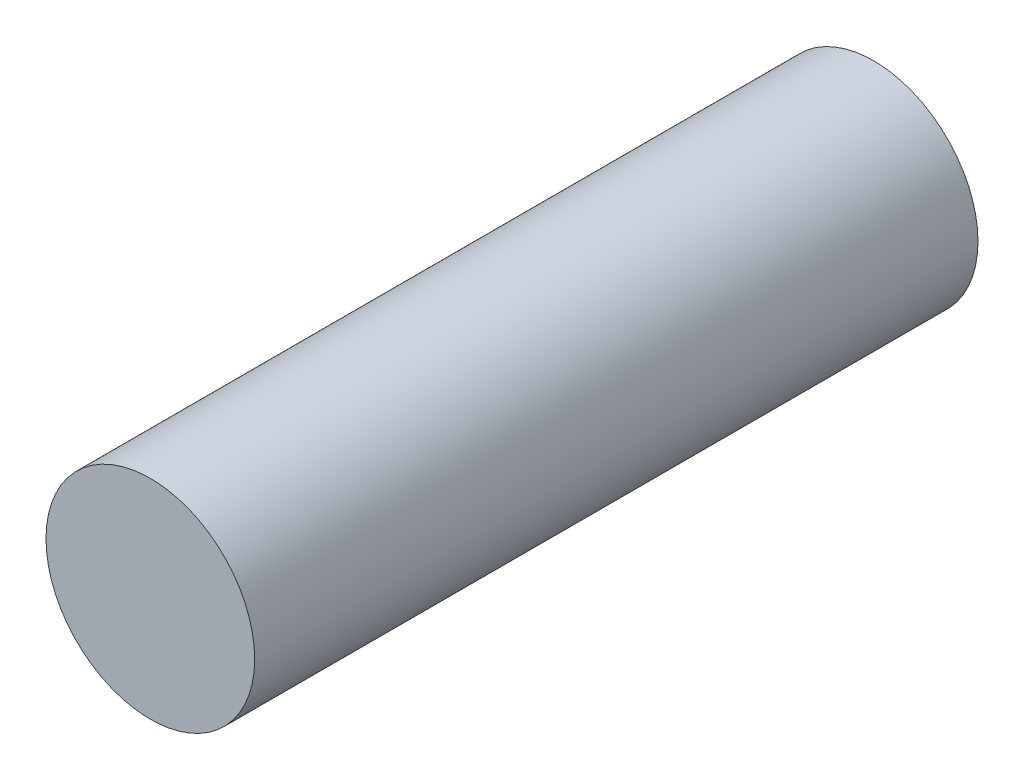
ISO-10303-21;
HEADER;
FILE_DESCRIPTION(('STEP AP214'),'2;1');
FILE_NAME('part.step','',(''),(''),'','','');
FILE_SCHEMA(('AUTOMOTIVE_DESIGN { 1 0 10303 214 1 1 1 1 }'));
ENDSEC;
DATA;
#1=APPLICATION_CONTEXT('core data for automotive mechanical design processes');
#2=APPLICATION_PROTOCOL_DEFINITION('international standard','automotive_design',2000,#1);
#3=PRODUCT_CONTEXT('',#1,'mechanical');
#4=PRODUCT('Part','Part','',(#3));
#5=PRODUCT_RELATED_PRODUCT_CATEGORY('part','',(#4));
#6=PRODUCT_DEFINITION_FORMATION('','',#4);
#7=PRODUCT_DEFINITION_CONTEXT('part definition',#1,'design');
#8=PRODUCT_DEFINITION('design','',#6,#7);
#9=PRODUCT_DEFINITION_SHAPE('','',#8);
#10=(LENGTH_UNIT() NAMED_UNIT(*) SI_UNIT(.MILLI.,.METRE.));
#11=(NAMED_UNIT(*) PLANE_ANGLE_UNIT() SI_UNIT($,.RADIAN.));
#12=(NAMED_UNIT(*) SI_UNIT($,.STERADIAN.) SOLID_ANGLE_UNIT());
#13=UNCERTAINTY_MEASURE_WITH_UNIT(LENGTH_MEASURE(1.E-05),#10,'distance_accuracy_value','');
#14=(GEOMETRIC_REPRESENTATION_CONTEXT(3) GLOBAL_UNCERTAINTY_ASSIGNED_CONTEXT((#13)) GLOBAL_UNIT_ASSIGNED_CONTEXT((#10,
#11,#12)) REPRESENTATION_CONTEXT('',''));
#15=CARTESIAN_POINT('',(0.,0.,0.));
#16=DIRECTION('',(0.,0.,1.));
#17=DIRECTION('',(1.,0.,0.));
#18=AXIS2_PLACEMENT_3D('',#15,#16,#17);
#19=CARTESIAN_POINT('',(0.,0.,48.7));
#20=DIRECTION('',(0.,0.,-1.));
#21=DIRECTION('',(-1.,0.,0.));
#22=AXIS2_PLACEMENT_3D('',#19,#20,#21);
#23=CYLINDRICAL_SURFACE('',#22,7.025);
#24=CARTESIAN_POINT('',(0.,0.,48.7));
#25=DIRECTION('',(0.,0.,1.));
#26=DIRECTION('',(1.,0.,0.));
#27=AXIS2_PLACEMENT_3D('',#24,#25,#26);
#28=CIRCLE('',#27,7.025);
#29=CARTESIAN_POINT('',(7.025,0.,48.7));
#30=VERTEX_POINT('',#29);
#31=EDGE_CURVE('E10',#30,#30,#28,.T.);
#32=ORIENTED_EDGE('',*,*,#31,.F.);
#33=EDGE_LOOP('',(#32));
#34=FACE_BOUND('',#33,.T.);
#35=CARTESIAN_POINT('',(0.,0.,0.));
#36=DIRECTION('',(0.,0.,1.));
#37=DIRECTION('',(1.,0.,0.));
#38=AXIS2_PLACEMENT_3D('',#35,#36,#37);
#39=CIRCLE('',#38,7.025);
#40=CARTESIAN_POINT('',(7.025,0.,0.));
#41=VERTEX_POINT('',#40);
#42=EDGE_CURVE('E36',#41,#41,#39,.T.);
#43=ORIENTED_EDGE('',*,*,#42,.T.);
#44=EDGE_LOOP('',(#43));
#45=FACE_BOUND('',#44,.T.);
#46=ADVANCED_FACE('F33',(#34,#45),#23,.T.);
#47=CARTESIAN_POINT('',(0.,0.,48.7));
#48=DIRECTION('',(0.,0.,1.));
#49=DIRECTION('',(1.,0.,0.));
#50=AXIS2_PLACEMENT_3D('',#47,#48,#49);
#51=PLANE('',#50);
#52=ORIENTED_EDGE('',*,*,#31,.T.);
#53=EDGE_LOOP('',(#52));
#54=FACE_BOUND('',#53,.T.);
#55=ADVANCED_FACE('F48',(#54),#51,.T.);
#56=CARTESIAN_POINT('',(0.,0.,0.));
#57=DIRECTION('',(0.,0.,1.));
#58=DIRECTION('',(1.,0.,0.));
#59=AXIS2_PLACEMENT_3D('',#56,#57,#58);
#60=PLANE('',#59);
#61=ORIENTED_EDGE('',*,*,#42,.F.);
#62=EDGE_LOOP('',(#61));
#63=FACE_BOUND('',#62,.T.);
#64=ADVANCED_FACE('F46',(#63),#60,.F.);
#65=CLOSED_SHELL('',(#46,#55,#64));
#66=MANIFOLD_SOLID_BREP('B2',#65);
#67=ADVANCED_BREP_SHAPE_REPRESENTATION('',(#18,#66),#14);
#68=SHAPE_DEFINITION_REPRESENTATION(#9,#67);
ENDSEC;
END-ISO-10303-21;
